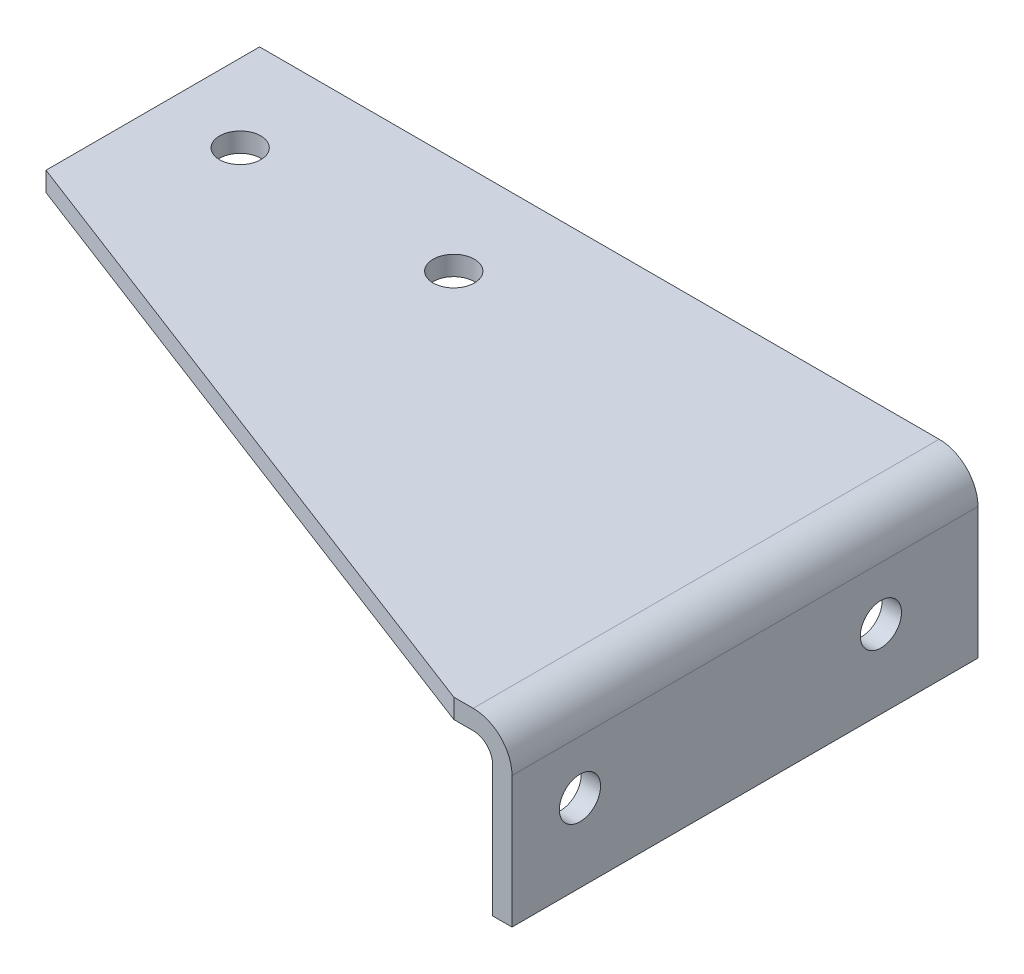
ISO-10303-21;
HEADER;
FILE_DESCRIPTION(('STEP AP214'),'2;1');
FILE_NAME('part.step','',(''),(''),'','','');
FILE_SCHEMA(('AUTOMOTIVE_DESIGN { 1 0 10303 214 1 1 1 1 }'));
ENDSEC;
DATA;
#1=APPLICATION_CONTEXT('core data for automotive mechanical design processes');
#2=APPLICATION_PROTOCOL_DEFINITION('international standard','automotive_design',2000,#1);
#3=PRODUCT_CONTEXT('',#1,'mechanical');
#4=PRODUCT('Part','Part','',(#3));
#5=PRODUCT_RELATED_PRODUCT_CATEGORY('part','',(#4));
#6=PRODUCT_DEFINITION_FORMATION('','',#4);
#7=PRODUCT_DEFINITION_CONTEXT('part definition',#1,'design');
#8=PRODUCT_DEFINITION('design','',#6,#7);
#9=PRODUCT_DEFINITION_SHAPE('','',#8);
#10=(LENGTH_UNIT() NAMED_UNIT(*) SI_UNIT(.MILLI.,.METRE.));
#11=(NAMED_UNIT(*) PLANE_ANGLE_UNIT() SI_UNIT($,.RADIAN.));
#12=(NAMED_UNIT(*) SI_UNIT($,.STERADIAN.) SOLID_ANGLE_UNIT());
#13=UNCERTAINTY_MEASURE_WITH_UNIT(LENGTH_MEASURE(1.E-05),#10,'distance_accuracy_value','');
#14=(GEOMETRIC_REPRESENTATION_CONTEXT(3) GLOBAL_UNCERTAINTY_ASSIGNED_CONTEXT((#13)) GLOBAL_UNIT_ASSIGNED_CONTEXT((#10,
#11,#12)) REPRESENTATION_CONTEXT('',''));
#15=CARTESIAN_POINT('',(0.,0.,0.));
#16=DIRECTION('',(0.,0.,1.));
#17=DIRECTION('',(1.,0.,0.));
#18=AXIS2_PLACEMENT_3D('',#15,#16,#17);
#19=CARTESIAN_POINT('',(0.,-6.35,152.4));
#20=DIRECTION('',(1.,0.,0.));
#21=DIRECTION('',(0.,1.,0.));
#22=AXIS2_PLACEMENT_3D('',#19,#20,#21);
#23=PLANE('',#22);
#24=CARTESIAN_POINT('',(0.,-23.8125,130.175));
#25=DIRECTION('',(1.,0.,0.));
#26=DIRECTION('',(0.,1.,0.));
#27=AXIS2_PLACEMENT_3D('',#24,#25,#26);
#28=CIRCLE('',#27,6.731);
#29=CARTESIAN_POINT('',(0.,-17.0815,130.175));
#30=VERTEX_POINT('',#29);
#31=EDGE_CURVE('E183',#30,#30,#28,.T.);
#32=ORIENTED_EDGE('',*,*,#31,.T.);
#33=EDGE_LOOP('',(#32));
#34=FACE_BOUND('',#33,.T.);
#35=CARTESIAN_POINT('',(0.,-23.8125,31.75));
#36=DIRECTION('',(1.,0.,0.));
#37=DIRECTION('',(0.,1.,0.));
#38=AXIS2_PLACEMENT_3D('',#35,#36,#37);
#39=CIRCLE('',#38,6.731);
#40=CARTESIAN_POINT('',(0.,-17.0815,31.75));
#41=VERTEX_POINT('',#40);
#42=EDGE_CURVE('E124',#41,#41,#39,.T.);
#43=ORIENTED_EDGE('',*,*,#42,.T.);
#44=EDGE_LOOP('',(#43));
#45=FACE_BOUND('',#44,.T.);
#46=DIRECTION('',(0.,-1.,0.));
#47=VECTOR('',#46,1.);
#48=CARTESIAN_POINT('',(0.,-6.35,0.));
#49=LINE('',#48,#47);
#50=CARTESIAN_POINT('',(0.,-6.35,0.));
#51=VERTEX_POINT('',#50);
#52=CARTESIAN_POINT('',(0.,-49.276,0.));
#53=VERTEX_POINT('',#52);
#54=EDGE_CURVE('E120',#51,#53,#49,.T.);
#55=ORIENTED_EDGE('',*,*,#54,.T.);
#56=DIRECTION('',(0.,0.,-1.));
#57=VECTOR('',#56,1.);
#58=CARTESIAN_POINT('',(0.,-49.276,152.4));
#59=LINE('',#58,#57);
#60=CARTESIAN_POINT('',(0.,-49.276,152.4));
#61=VERTEX_POINT('',#60);
#62=EDGE_CURVE('E40',#61,#53,#59,.T.);
#63=ORIENTED_EDGE('',*,*,#62,.F.);
#64=DIRECTION('',(0.,-1.,0.));
#65=VECTOR('',#64,1.);
#66=CARTESIAN_POINT('',(0.,-6.35,152.4));
#67=LINE('',#66,#65);
#68=CARTESIAN_POINT('',(0.,-6.35,152.4));
#69=VERTEX_POINT('',#68);
#70=EDGE_CURVE('E149',#69,#61,#67,.T.);
#71=ORIENTED_EDGE('',*,*,#70,.F.);
#72=DIRECTION('',(0.,0.,-1.));
#73=VECTOR('',#72,1.);
#74=CARTESIAN_POINT('',(0.,-6.35,152.4));
#75=LINE('',#74,#73);
#76=EDGE_CURVE('E161',#69,#51,#75,.T.);
#77=ORIENTED_EDGE('',*,*,#76,.T.);
#78=EDGE_LOOP('',(#55,#63,#71,#77));
#79=FACE_BOUND('',#78,.T.);
#80=ADVANCED_FACE('F32',(#34,#45,#79),#23,.F.);
#81=CARTESIAN_POINT('',(6.35000000000001,-49.276,152.4));
#82=DIRECTION('',(0.,-1.,0.));
#83=DIRECTION('',(0.,0.,-1.));
#84=AXIS2_PLACEMENT_3D('',#81,#82,#83);
#85=PLANE('',#84);
#86=DIRECTION('',(-1.,0.,0.));
#87=VECTOR('',#86,1.);
#88=CARTESIAN_POINT('',(6.35000000000001,-49.276,0.));
#89=LINE('',#88,#87);
#90=CARTESIAN_POINT('',(6.35000000000001,-49.276,0.));
#91=VERTEX_POINT('',#90);
#92=EDGE_CURVE('E130',#91,#53,#89,.T.);
#93=ORIENTED_EDGE('',*,*,#92,.F.);
#94=DIRECTION('',(0.,0.,-1.));
#95=VECTOR('',#94,1.);
#96=CARTESIAN_POINT('',(6.35000000000001,-49.276,152.4));
#97=LINE('',#96,#95);
#98=CARTESIAN_POINT('',(6.35000000000001,-49.276,152.4));
#99=VERTEX_POINT('',#98);
#100=EDGE_CURVE('E174',#99,#91,#97,.T.);
#101=ORIENTED_EDGE('',*,*,#100,.F.);
#102=DIRECTION('',(-1.,0.,0.));
#103=VECTOR('',#102,1.);
#104=CARTESIAN_POINT('',(6.35000000000001,-49.276,152.4));
#105=LINE('',#104,#103);
#106=EDGE_CURVE('E151',#99,#61,#105,.T.);
#107=ORIENTED_EDGE('',*,*,#106,.T.);
#108=ORIENTED_EDGE('',*,*,#62,.T.);
#109=EDGE_LOOP('',(#93,#101,#107,#108));
#110=FACE_BOUND('',#109,.T.);
#111=ADVANCED_FACE('F217',(#110),#85,.T.);
#112=CARTESIAN_POINT('',(6.35,-6.35,152.4));
#113=DIRECTION('',(1.,0.,0.));
#114=DIRECTION('',(0.,1.,0.));
#115=AXIS2_PLACEMENT_3D('',#112,#113,#114);
#116=PLANE('',#115);
#117=CARTESIAN_POINT('',(6.35,-23.8125,130.175));
#118=DIRECTION('',(1.,0.,0.));
#119=DIRECTION('',(0.,0.,-1.));
#120=AXIS2_PLACEMENT_3D('',#117,#118,#119);
#121=CIRCLE('',#120,6.73100000000001);
#122=CARTESIAN_POINT('',(6.35,-23.8125,123.444));
#123=VERTEX_POINT('',#122);
#124=EDGE_CURVE('E178',#123,#123,#121,.T.);
#125=ORIENTED_EDGE('',*,*,#124,.F.);
#126=EDGE_LOOP('',(#125));
#127=FACE_BOUND('',#126,.T.);
#128=CARTESIAN_POINT('',(6.35,-23.8125,31.75));
#129=DIRECTION('',(1.,0.,0.));
#130=DIRECTION('',(0.,0.,-1.));
#131=AXIS2_PLACEMENT_3D('',#128,#129,#130);
#132=CIRCLE('',#131,6.73100000000001);
#133=CARTESIAN_POINT('',(6.35,-23.8125,25.019));
#134=VERTEX_POINT('',#133);
#135=EDGE_CURVE('E195',#134,#134,#132,.T.);
#136=ORIENTED_EDGE('',*,*,#135,.F.);
#137=EDGE_LOOP('',(#136));
#138=FACE_BOUND('',#137,.T.);
#139=DIRECTION('',(0.,-1.,0.));
#140=VECTOR('',#139,1.);
#141=CARTESIAN_POINT('',(6.35,-6.35,0.));
#142=LINE('',#141,#140);
#143=CARTESIAN_POINT('',(6.35,-6.35,0.));
#144=VERTEX_POINT('',#143);
#145=EDGE_CURVE('E133',#144,#91,#142,.T.);
#146=ORIENTED_EDGE('',*,*,#145,.F.);
#147=DIRECTION('',(0.,0.,-1.));
#148=VECTOR('',#147,1.);
#149=CARTESIAN_POINT('',(6.35,-6.35,152.4));
#150=LINE('',#149,#148);
#151=CARTESIAN_POINT('',(6.35,-6.35,152.4));
#152=VERTEX_POINT('',#151);
#153=EDGE_CURVE('E172',#152,#144,#150,.T.);
#154=ORIENTED_EDGE('',*,*,#153,.F.);
#155=DIRECTION('',(0.,-1.,0.));
#156=VECTOR('',#155,1.);
#157=CARTESIAN_POINT('',(6.35,-6.35,152.4));
#158=LINE('',#157,#156);
#159=EDGE_CURVE('E154',#152,#99,#158,.T.);
#160=ORIENTED_EDGE('',*,*,#159,.T.);
#161=ORIENTED_EDGE('',*,*,#100,.T.);
#162=EDGE_LOOP('',(#146,#154,#160,#161));
#163=FACE_BOUND('',#162,.T.);
#164=ADVANCED_FACE('F222',(#127,#138,#163),#116,.T.);
#165=CARTESIAN_POINT('',(-6.35,-6.35,152.4));
#166=DIRECTION('',(0.,0.,-1.));
#167=DIRECTION('',(-1.,0.,0.));
#168=AXIS2_PLACEMENT_3D('',#165,#166,#167);
#169=CYLINDRICAL_SURFACE('',#168,12.7);
#170=CARTESIAN_POINT('',(-6.35,-6.35,0.));
#171=DIRECTION('',(0.,0.,1.));
#172=DIRECTION('',(1.,0.,0.));
#173=AXIS2_PLACEMENT_3D('',#170,#171,#172);
#174=CIRCLE('',#173,12.7);
#175=CARTESIAN_POINT('',(-6.35,6.35,0.));
#176=VERTEX_POINT('',#175);
#177=EDGE_CURVE('E136',#176,#144,#174,.F.);
#178=ORIENTED_EDGE('',*,*,#177,.F.);
#179=DIRECTION('',(0.,0.,-1.));
#180=VECTOR('',#179,1.);
#181=CARTESIAN_POINT('',(-6.35,6.35,152.4));
#182=LINE('',#181,#180);
#183=CARTESIAN_POINT('',(-6.35,6.35,152.4));
#184=VERTEX_POINT('',#183);
#185=EDGE_CURVE('E170',#184,#176,#182,.T.);
#186=ORIENTED_EDGE('',*,*,#185,.F.);
#187=CARTESIAN_POINT('',(-6.35,-6.35,152.4));
#188=DIRECTION('',(0.,0.,1.));
#189=DIRECTION('',(1.,0.,0.));
#190=AXIS2_PLACEMENT_3D('',#187,#188,#189);
#191=CIRCLE('',#190,12.7);
#192=EDGE_CURVE('E109',#184,#152,#191,.F.);
#193=ORIENTED_EDGE('',*,*,#192,.T.);
#194=ORIENTED_EDGE('',*,*,#153,.T.);
#195=EDGE_LOOP('',(#178,#186,#193,#194));
#196=FACE_BOUND('',#195,.T.);
#197=ADVANCED_FACE('F229',(#196),#169,.T.);
#198=CARTESIAN_POINT('',(-228.6,6.35,152.4));
#199=DIRECTION('',(0.,1.,0.));
#200=DIRECTION('',(0.,0.,1.));
#201=AXIS2_PLACEMENT_3D('',#198,#199,#200);
#202=PLANE('',#201);
#203=CARTESIAN_POINT('',(-203.200000000001,6.35,31.7500000000033));
#204=DIRECTION('',(0.,1.,0.));
#205=DIRECTION('',(0.,0.,1.));
#206=AXIS2_PLACEMENT_3D('',#203,#204,#205);
#207=CIRCLE('',#206,6.74687500000001);
#208=CARTESIAN_POINT('',(-203.200000000001,6.35,38.4968750000033));
#209=VERTEX_POINT('',#208);
#210=EDGE_CURVE('E190',#209,#209,#207,.T.);
#211=ORIENTED_EDGE('',*,*,#210,.F.);
#212=EDGE_LOOP('',(#211));
#213=FACE_BOUND('',#212,.T.);
#214=CARTESIAN_POINT('',(-133.35,6.35,31.7500000000032));
#215=DIRECTION('',(0.,1.,0.));
#216=DIRECTION('',(0.,0.,1.));
#217=AXIS2_PLACEMENT_3D('',#214,#215,#216);
#218=CIRCLE('',#217,6.74687500000001);
#219=CARTESIAN_POINT('',(-133.35,6.35,38.4968750000032));
#220=VERTEX_POINT('',#219);
#221=EDGE_CURVE('E179',#220,#220,#218,.T.);
#222=ORIENTED_EDGE('',*,*,#221,.F.);
#223=EDGE_LOOP('',(#222));
#224=FACE_BOUND('',#223,.T.);
#225=DIRECTION('',(-0.934051834851091,0.,-0.357137466266577));
#226=VECTOR('',#225,1.);
#227=CARTESIAN_POINT('',(-201.062566037738,6.35,80.379018867927));
#228=LINE('',#227,#226);
#229=CARTESIAN_POINT('',(-12.7,6.35000000000002,152.4));
#230=VERTEX_POINT('',#229);
#231=CARTESIAN_POINT('',(-228.6,6.35,69.8500000000039));
#232=VERTEX_POINT('',#231);
#233=EDGE_CURVE('E115',#230,#232,#228,.T.);
#234=ORIENTED_EDGE('',*,*,#233,.F.);
#235=DIRECTION('',(1.,0.,0.));
#236=VECTOR('',#235,1.);
#237=CARTESIAN_POINT('',(-228.6,6.35,152.4));
#238=LINE('',#237,#236);
#239=EDGE_CURVE('E104',#230,#184,#238,.T.);
#240=ORIENTED_EDGE('',*,*,#239,.T.);
#241=ORIENTED_EDGE('',*,*,#185,.T.);
#242=DIRECTION('',(1.,0.,0.));
#243=VECTOR('',#242,1.);
#244=CARTESIAN_POINT('',(-228.6,6.35,0.));
#245=LINE('',#244,#243);
#246=CARTESIAN_POINT('',(-228.6,6.35,0.));
#247=VERTEX_POINT('',#246);
#248=EDGE_CURVE('E139',#247,#176,#245,.T.);
#249=ORIENTED_EDGE('',*,*,#248,.F.);
#250=DIRECTION('',(0.,0.,-1.));
#251=VECTOR('',#250,1.);
#252=CARTESIAN_POINT('',(-228.6,6.35,152.4));
#253=LINE('',#252,#251);
#254=EDGE_CURVE('E118',#232,#247,#253,.T.);
#255=ORIENTED_EDGE('',*,*,#254,.F.);
#256=EDGE_LOOP('',(#234,#240,#241,#249,#255));
#257=FACE_BOUND('',#256,.T.);
#258=ADVANCED_FACE('F116',(#213,#224,#257),#202,.T.);
#259=CARTESIAN_POINT('',(-228.6,0.,152.4));
#260=DIRECTION('',(-1.,0.,0.));
#261=DIRECTION('',(0.,0.,1.));
#262=AXIS2_PLACEMENT_3D('',#259,#260,#261);
#263=PLANE('',#262);
#264=DIRECTION('',(0.,-1.,0.));
#265=VECTOR('',#264,1.);
#266=CARTESIAN_POINT('',(-228.6,418.494658465093,69.8500000000038));
#267=LINE('',#266,#265);
#268=CARTESIAN_POINT('',(-228.6,0.,69.8500000000038));
#269=VERTEX_POINT('',#268);
#270=EDGE_CURVE('E48',#232,#269,#267,.T.);
#271=ORIENTED_EDGE('',*,*,#270,.F.);
#272=ORIENTED_EDGE('',*,*,#254,.T.);
#273=DIRECTION('',(0.,1.,0.));
#274=VECTOR('',#273,1.);
#275=CARTESIAN_POINT('',(-228.6,0.,0.));
#276=LINE('',#275,#274);
#277=CARTESIAN_POINT('',(-228.6,0.,0.));
#278=VERTEX_POINT('',#277);
#279=EDGE_CURVE('E142',#278,#247,#276,.T.);
#280=ORIENTED_EDGE('',*,*,#279,.F.);
#281=DIRECTION('',(0.,0.,-1.));
#282=VECTOR('',#281,1.);
#283=CARTESIAN_POINT('',(-228.6,0.,152.4));
#284=LINE('',#283,#282);
#285=EDGE_CURVE('E167',#269,#278,#284,.T.);
#286=ORIENTED_EDGE('',*,*,#285,.F.);
#287=EDGE_LOOP('',(#271,#272,#280,#286));
#288=FACE_BOUND('',#287,.T.);
#289=ADVANCED_FACE('F239',(#288),#263,.T.);
#290=CARTESIAN_POINT('',(-228.6,0.,152.4));
#291=DIRECTION('',(0.,1.,0.));
#292=DIRECTION('',(0.,0.,1.));
#293=AXIS2_PLACEMENT_3D('',#290,#291,#292);
#294=PLANE('',#293);
#295=CARTESIAN_POINT('',(-203.200000000001,0.,31.7500000000033));
#296=DIRECTION('',(0.,1.,0.));
#297=DIRECTION('',(0.,0.,1.));
#298=AXIS2_PLACEMENT_3D('',#295,#296,#297);
#299=CIRCLE('',#298,6.74687500000001);
#300=CARTESIAN_POINT('',(-203.200000000001,0.,38.4968750000033));
#301=VERTEX_POINT('',#300);
#302=EDGE_CURVE('E35',#301,#301,#299,.T.);
#303=ORIENTED_EDGE('',*,*,#302,.T.);
#304=EDGE_LOOP('',(#303));
#305=FACE_BOUND('',#304,.T.);
#306=CARTESIAN_POINT('',(-133.35,0.,31.7500000000032));
#307=DIRECTION('',(0.,1.,0.));
#308=DIRECTION('',(0.,0.,1.));
#309=AXIS2_PLACEMENT_3D('',#306,#307,#308);
#310=CIRCLE('',#309,6.74687500000001);
#311=CARTESIAN_POINT('',(-133.35,0.,38.4968750000032));
#312=VERTEX_POINT('',#311);
#313=EDGE_CURVE('E176',#312,#312,#310,.T.);
#314=ORIENTED_EDGE('',*,*,#313,.T.);
#315=EDGE_LOOP('',(#314));
#316=FACE_BOUND('',#315,.T.);
#317=DIRECTION('',(1.,0.,0.));
#318=VECTOR('',#317,1.);
#319=CARTESIAN_POINT('',(-228.6,0.,152.4));
#320=LINE('',#319,#318);
#321=CARTESIAN_POINT('',(-12.7,0.,152.4));
#322=VERTEX_POINT('',#321);
#323=CARTESIAN_POINT('',(-6.35,0.,152.4));
#324=VERTEX_POINT('',#323);
#325=EDGE_CURVE('E112',#322,#324,#320,.T.);
#326=ORIENTED_EDGE('',*,*,#325,.F.);
#327=DIRECTION('',(-0.934051834851091,0.,-0.357137466266577));
#328=VECTOR('',#327,1.);
#329=CARTESIAN_POINT('',(-201.062566037738,0.,80.379018867927));
#330=LINE('',#329,#328);
#331=EDGE_CURVE('E56',#322,#269,#330,.T.);
#332=ORIENTED_EDGE('',*,*,#331,.T.);
#333=ORIENTED_EDGE('',*,*,#285,.T.);
#334=DIRECTION('',(1.,0.,0.));
#335=VECTOR('',#334,1.);
#336=CARTESIAN_POINT('',(-228.6,0.,0.));
#337=LINE('',#336,#335);
#338=CARTESIAN_POINT('',(-6.35,0.,0.));
#339=VERTEX_POINT('',#338);
#340=EDGE_CURVE('E145',#278,#339,#337,.T.);
#341=ORIENTED_EDGE('',*,*,#340,.T.);
#342=DIRECTION('',(0.,0.,-1.));
#343=VECTOR('',#342,1.);
#344=CARTESIAN_POINT('',(-6.35,0.,152.4));
#345=LINE('',#344,#343);
#346=EDGE_CURVE('E164',#324,#339,#345,.T.);
#347=ORIENTED_EDGE('',*,*,#346,.F.);
#348=EDGE_LOOP('',(#326,#332,#333,#341,#347));
#349=FACE_BOUND('',#348,.T.);
#350=ADVANCED_FACE('F243',(#305,#316,#349),#294,.F.);
#351=CARTESIAN_POINT('',(-6.35,-6.35,152.4));
#352=DIRECTION('',(0.,0.,-1.));
#353=DIRECTION('',(-1.,0.,0.));
#354=AXIS2_PLACEMENT_3D('',#351,#352,#353);
#355=CYLINDRICAL_SURFACE('',#354,6.35);
#356=CARTESIAN_POINT('',(-6.35,-6.35,0.));
#357=DIRECTION('',(0.,0.,-1.));
#358=DIRECTION('',(-1.,0.,0.));
#359=AXIS2_PLACEMENT_3D('',#356,#357,#358);
#360=CIRCLE('',#359,6.35);
#361=EDGE_CURVE('E147',#339,#51,#360,.T.);
#362=ORIENTED_EDGE('',*,*,#361,.T.);
#363=ORIENTED_EDGE('',*,*,#76,.F.);
#364=CARTESIAN_POINT('',(-6.35,-6.35,152.4));
#365=DIRECTION('',(0.,0.,-1.));
#366=DIRECTION('',(-1.,0.,0.));
#367=AXIS2_PLACEMENT_3D('',#364,#365,#366);
#368=CIRCLE('',#367,6.35);
#369=EDGE_CURVE('E159',#324,#69,#368,.T.);
#370=ORIENTED_EDGE('',*,*,#369,.F.);
#371=ORIENTED_EDGE('',*,*,#346,.T.);
#372=EDGE_LOOP('',(#362,#363,#370,#371));
#373=FACE_BOUND('',#372,.T.);
#374=ADVANCED_FACE('F246',(#373),#355,.F.);
#375=CARTESIAN_POINT('',(-6.35,-6.35,152.4));
#376=DIRECTION('',(0.,0.,1.));
#377=DIRECTION('',(1.,0.,0.));
#378=AXIS2_PLACEMENT_3D('',#375,#376,#377);
#379=PLANE('',#378);
#380=DIRECTION('',(0.,1.,0.));
#381=VECTOR('',#380,1.);
#382=CARTESIAN_POINT('',(-12.7,-6.35,152.4));
#383=LINE('',#382,#381);
#384=EDGE_CURVE('E11',#322,#230,#383,.T.);
#385=ORIENTED_EDGE('',*,*,#384,.F.);
#386=ORIENTED_EDGE('',*,*,#325,.T.);
#387=ORIENTED_EDGE('',*,*,#369,.T.);
#388=ORIENTED_EDGE('',*,*,#70,.T.);
#389=ORIENTED_EDGE('',*,*,#106,.F.);
#390=ORIENTED_EDGE('',*,*,#159,.F.);
#391=ORIENTED_EDGE('',*,*,#192,.F.);
#392=ORIENTED_EDGE('',*,*,#239,.F.);
#393=EDGE_LOOP('',(#385,#386,#387,#388,#389,#390,#391,#392));
#394=FACE_BOUND('',#393,.T.);
#395=ADVANCED_FACE('F106',(#394),#379,.T.);
#396=CARTESIAN_POINT('',(-6.35,-6.35,0.));
#397=DIRECTION('',(0.,0.,1.));
#398=DIRECTION('',(1.,0.,0.));
#399=AXIS2_PLACEMENT_3D('',#396,#397,#398);
#400=PLANE('',#399);
#401=ORIENTED_EDGE('',*,*,#54,.F.);
#402=ORIENTED_EDGE('',*,*,#361,.F.);
#403=ORIENTED_EDGE('',*,*,#340,.F.);
#404=ORIENTED_EDGE('',*,*,#279,.T.);
#405=ORIENTED_EDGE('',*,*,#248,.T.);
#406=ORIENTED_EDGE('',*,*,#177,.T.);
#407=ORIENTED_EDGE('',*,*,#145,.T.);
#408=ORIENTED_EDGE('',*,*,#92,.T.);
#409=EDGE_LOOP('',(#401,#402,#403,#404,#405,#406,#407,#408));
#410=FACE_BOUND('',#409,.T.);
#411=ADVANCED_FACE('F214',(#410),#400,.F.);
#412=CARTESIAN_POINT('',(-228.6,418.494658465093,69.8500000000038));
#413=DIRECTION('',(0.357137466266577,0.,-0.934051834851091));
#414=DIRECTION('',(-0.934051834851091,0.,-0.357137466266577));
#415=AXIS2_PLACEMENT_3D('',#412,#413,#414);
#416=PLANE('',#415);
#417=ORIENTED_EDGE('',*,*,#384,.T.);
#418=ORIENTED_EDGE('',*,*,#233,.T.);
#419=ORIENTED_EDGE('',*,*,#270,.T.);
#420=ORIENTED_EDGE('',*,*,#331,.F.);
#421=EDGE_LOOP('',(#417,#418,#419,#420));
#422=FACE_BOUND('',#421,.T.);
#423=ADVANCED_FACE('F122',(#422),#416,.F.);
#424=CARTESIAN_POINT('',(6.35,-23.8125,31.75));
#425=DIRECTION('',(1.,0.,0.));
#426=DIRECTION('',(0.,0.,-1.));
#427=AXIS2_PLACEMENT_3D('',#424,#425,#426);
#428=CYLINDRICAL_SURFACE('',#427,6.731);
#429=ORIENTED_EDGE('',*,*,#135,.T.);
#430=EDGE_LOOP('',(#429));
#431=FACE_BOUND('',#430,.T.);
#432=ORIENTED_EDGE('',*,*,#42,.F.);
#433=EDGE_LOOP('',(#432));
#434=FACE_BOUND('',#433,.T.);
#435=ADVANCED_FACE('F202',(#431,#434),#428,.F.);
#436=CARTESIAN_POINT('',(6.35,-23.8125,130.175));
#437=DIRECTION('',(1.,0.,0.));
#438=DIRECTION('',(0.,0.,-1.));
#439=AXIS2_PLACEMENT_3D('',#436,#437,#438);
#440=CYLINDRICAL_SURFACE('',#439,6.731);
#441=ORIENTED_EDGE('',*,*,#124,.T.);
#442=EDGE_LOOP('',(#441));
#443=FACE_BOUND('',#442,.T.);
#444=ORIENTED_EDGE('',*,*,#31,.F.);
#445=EDGE_LOOP('',(#444));
#446=FACE_BOUND('',#445,.T.);
#447=ADVANCED_FACE('F204',(#443,#446),#440,.F.);
#448=CARTESIAN_POINT('',(-133.35,6.35,31.7500000000032));
#449=DIRECTION('',(0.,1.,0.));
#450=DIRECTION('',(0.,0.,1.));
#451=AXIS2_PLACEMENT_3D('',#448,#449,#450);
#452=CYLINDRICAL_SURFACE('',#451,6.74687500000001);
#453=ORIENTED_EDGE('',*,*,#221,.T.);
#454=EDGE_LOOP('',(#453));
#455=FACE_BOUND('',#454,.T.);
#456=ORIENTED_EDGE('',*,*,#313,.F.);
#457=EDGE_LOOP('',(#456));
#458=FACE_BOUND('',#457,.T.);
#459=ADVANCED_FACE('F211',(#455,#458),#452,.F.);
#460=CARTESIAN_POINT('',(-203.200000000001,6.35,31.7500000000033));
#461=DIRECTION('',(0.,1.,0.));
#462=DIRECTION('',(0.,0.,1.));
#463=AXIS2_PLACEMENT_3D('',#460,#461,#462);
#464=CYLINDRICAL_SURFACE('',#463,6.74687500000001);
#465=ORIENTED_EDGE('',*,*,#210,.T.);
#466=EDGE_LOOP('',(#465));
#467=FACE_BOUND('',#466,.T.);
#468=ORIENTED_EDGE('',*,*,#302,.F.);
#469=EDGE_LOOP('',(#468));
#470=FACE_BOUND('',#469,.T.);
#471=ADVANCED_FACE('F325',(#467,#470),#464,.F.);
#472=CLOSED_SHELL('',(#80,#111,#164,#197,#258,#289,#350,#374,#395,#411,#423,#435,#447,#459,#471));
#473=MANIFOLD_SOLID_BREP('B2',#472);
#474=ADVANCED_BREP_SHAPE_REPRESENTATION('',(#18,#473),#14);
#475=SHAPE_DEFINITION_REPRESENTATION(#9,#474);
ENDSEC;
END-ISO-10303-21;
